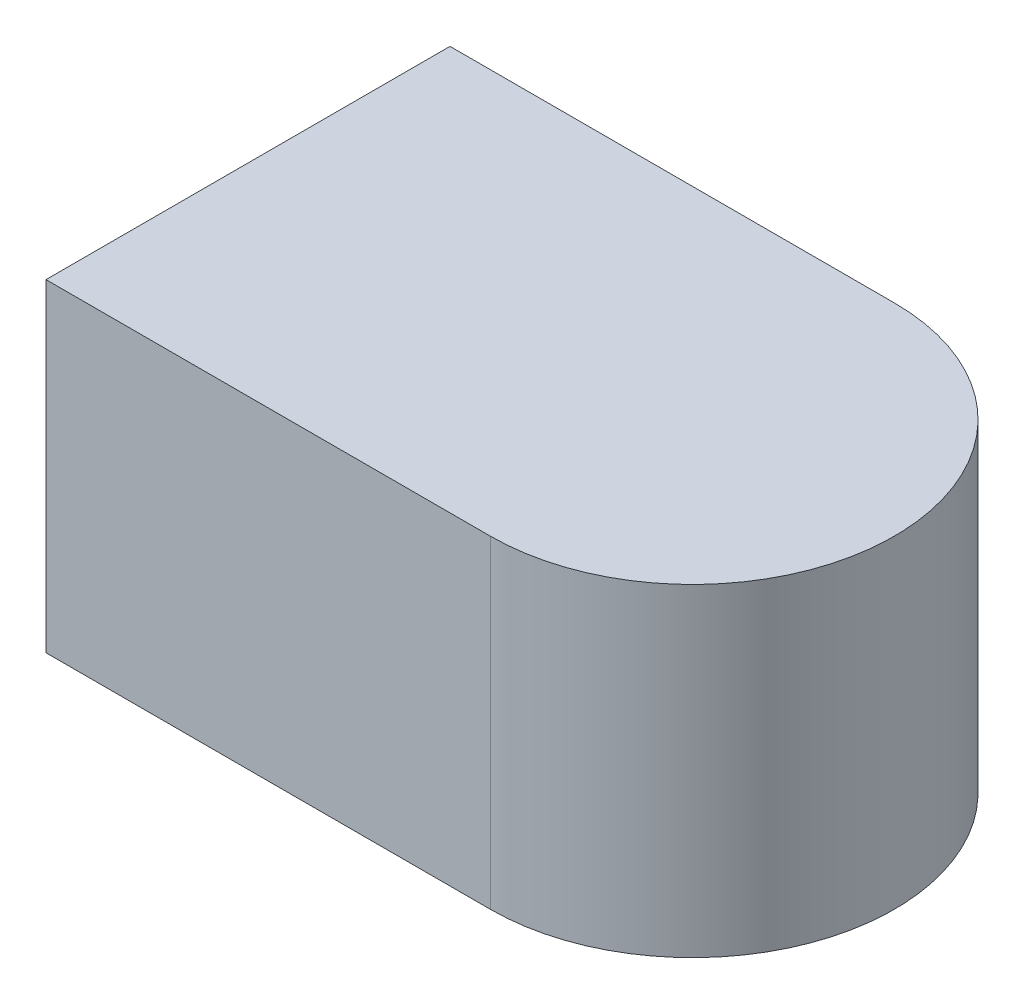
ISO-10303-21;
HEADER;
FILE_DESCRIPTION(('STEP AP214'),'2;1');
FILE_NAME('part.step','',(''),(''),'','','');
FILE_SCHEMA(('AUTOMOTIVE_DESIGN { 1 0 10303 214 1 1 1 1 }'));
ENDSEC;
DATA;
#1=APPLICATION_CONTEXT('core data for automotive mechanical design processes');
#2=APPLICATION_PROTOCOL_DEFINITION('international standard','automotive_design',2000,#1);
#3=PRODUCT_CONTEXT('',#1,'mechanical');
#4=PRODUCT('Part','Part','',(#3));
#5=PRODUCT_RELATED_PRODUCT_CATEGORY('part','',(#4));
#6=PRODUCT_DEFINITION_FORMATION('','',#4);
#7=PRODUCT_DEFINITION_CONTEXT('part definition',#1,'design');
#8=PRODUCT_DEFINITION('design','',#6,#7);
#9=PRODUCT_DEFINITION_SHAPE('','',#8);
#10=(LENGTH_UNIT() NAMED_UNIT(*) SI_UNIT(.MILLI.,.METRE.));
#11=(NAMED_UNIT(*) PLANE_ANGLE_UNIT() SI_UNIT($,.RADIAN.));
#12=(NAMED_UNIT(*) SI_UNIT($,.STERADIAN.) SOLID_ANGLE_UNIT());
#13=UNCERTAINTY_MEASURE_WITH_UNIT(LENGTH_MEASURE(1.E-05),#10,'distance_accuracy_value','');
#14=(GEOMETRIC_REPRESENTATION_CONTEXT(3) GLOBAL_UNCERTAINTY_ASSIGNED_CONTEXT((#13)) GLOBAL_UNIT_ASSIGNED_CONTEXT((#10,
#11,#12)) REPRESENTATION_CONTEXT('',''));
#15=CARTESIAN_POINT('',(0.,0.,0.));
#16=DIRECTION('',(0.,0.,1.));
#17=DIRECTION('',(1.,0.,0.));
#18=AXIS2_PLACEMENT_3D('',#15,#16,#17);
#19=CARTESIAN_POINT('',(0.,0.,0.));
#20=DIRECTION('',(0.,-1.,0.));
#21=DIRECTION('',(-1.,0.,0.));
#22=AXIS2_PLACEMENT_3D('',#19,#20,#21);
#23=PLANE('',#22);
#24=CARTESIAN_POINT('',(-1.225,0.,-0.25));
#25=DIRECTION('',(0.,-1.,0.));
#26=DIRECTION('',(0.,0.,-1.));
#27=AXIS2_PLACEMENT_3D('',#24,#25,#26);
#28=CIRCLE('',#27,0.125);
#29=CARTESIAN_POINT('',(-1.225,0.,-0.375));
#30=VERTEX_POINT('',#29);
#31=CARTESIAN_POINT('',(-1.225,0.,-0.125));
#32=VERTEX_POINT('',#31);
#33=EDGE_CURVE('E11',#30,#32,#28,.T.);
#34=ORIENTED_EDGE('',*,*,#33,.T.);
#35=DIRECTION('',(-1.,0.,0.));
#36=VECTOR('',#35,1.);
#37=CARTESIAN_POINT('',(-1.225,0.,-0.125));
#38=LINE('',#37,#36);
#39=CARTESIAN_POINT('',(-1.5,0.,-0.125));
#40=VERTEX_POINT('',#39);
#41=EDGE_CURVE('E24',#32,#40,#38,.T.);
#42=ORIENTED_EDGE('',*,*,#41,.T.);
#43=DIRECTION('',(0.,0.,-1.));
#44=VECTOR('',#43,1.);
#45=CARTESIAN_POINT('',(-1.5,0.,-0.125));
#46=LINE('',#45,#44);
#47=CARTESIAN_POINT('',(-1.5,0.,-0.375));
#48=VERTEX_POINT('',#47);
#49=EDGE_CURVE('E62',#40,#48,#46,.T.);
#50=ORIENTED_EDGE('',*,*,#49,.T.);
#51=DIRECTION('',(1.,0.,0.));
#52=VECTOR('',#51,1.);
#53=CARTESIAN_POINT('',(-1.5,0.,-0.375));
#54=LINE('',#53,#52);
#55=EDGE_CURVE('E36',#48,#30,#54,.T.);
#56=ORIENTED_EDGE('',*,*,#55,.T.);
#57=EDGE_LOOP('',(#34,#42,#50,#56));
#58=FACE_BOUND('',#57,.T.);
#59=ADVANCED_FACE('F17',(#58),#23,.T.);
#60=CARTESIAN_POINT('',(-1.5,0.,-0.375));
#61=DIRECTION('',(0.,0.,1.));
#62=DIRECTION('',(1.,0.,0.));
#63=AXIS2_PLACEMENT_3D('',#60,#61,#62);
#64=PLANE('',#63);
#65=DIRECTION('',(0.,1.,0.));
#66=VECTOR('',#65,1.);
#67=CARTESIAN_POINT('',(-1.5,0.,-0.375));
#68=LINE('',#67,#66);
#69=CARTESIAN_POINT('',(-1.5,0.2,-0.375));
#70=VERTEX_POINT('',#69);
#71=EDGE_CURVE('E84',#48,#70,#68,.T.);
#72=ORIENTED_EDGE('',*,*,#71,.T.);
#73=DIRECTION('',(1.,0.,0.));
#74=VECTOR('',#73,1.);
#75=CARTESIAN_POINT('',(-1.5,0.2,-0.375));
#76=LINE('',#75,#74);
#77=CARTESIAN_POINT('',(-1.225,0.2,-0.375));
#78=VERTEX_POINT('',#77);
#79=EDGE_CURVE('E74',#70,#78,#76,.T.);
#80=ORIENTED_EDGE('',*,*,#79,.T.);
#81=DIRECTION('',(0.,1.,0.));
#82=VECTOR('',#81,1.);
#83=CARTESIAN_POINT('',(-1.225,0.,-0.375));
#84=LINE('',#83,#82);
#85=EDGE_CURVE('E81',#30,#78,#84,.T.);
#86=ORIENTED_EDGE('',*,*,#85,.F.);
#87=ORIENTED_EDGE('',*,*,#55,.F.);
#88=EDGE_LOOP('',(#72,#80,#86,#87));
#89=FACE_BOUND('',#88,.T.);
#90=ADVANCED_FACE('F91',(#89),#64,.F.);
#91=CARTESIAN_POINT('',(-1.225,0.,-0.25));
#92=DIRECTION('',(0.,-1.,0.));
#93=DIRECTION('',(-1.,0.,0.));
#94=AXIS2_PLACEMENT_3D('',#91,#92,#93);
#95=CYLINDRICAL_SURFACE('',#94,0.125);
#96=ORIENTED_EDGE('',*,*,#85,.T.);
#97=CARTESIAN_POINT('',(-1.225,0.2,-0.25));
#98=DIRECTION('',(0.,-1.,0.));
#99=DIRECTION('',(0.,0.,-1.));
#100=AXIS2_PLACEMENT_3D('',#97,#98,#99);
#101=CIRCLE('',#100,0.125);
#102=CARTESIAN_POINT('',(-1.225,0.2,-0.125));
#103=VERTEX_POINT('',#102);
#104=EDGE_CURVE('E79',#78,#103,#101,.T.);
#105=ORIENTED_EDGE('',*,*,#104,.T.);
#106=DIRECTION('',(0.,1.,0.));
#107=VECTOR('',#106,1.);
#108=CARTESIAN_POINT('',(-1.225,0.,-0.125));
#109=LINE('',#108,#107);
#110=EDGE_CURVE('E68',#32,#103,#109,.T.);
#111=ORIENTED_EDGE('',*,*,#110,.F.);
#112=ORIENTED_EDGE('',*,*,#33,.F.);
#113=EDGE_LOOP('',(#96,#105,#111,#112));
#114=FACE_BOUND('',#113,.T.);
#115=ADVANCED_FACE('F89',(#114),#95,.T.);
#116=CARTESIAN_POINT('',(-1.225,0.,-0.125));
#117=DIRECTION('',(0.,0.,-1.));
#118=DIRECTION('',(-1.,0.,0.));
#119=AXIS2_PLACEMENT_3D('',#116,#117,#118);
#120=PLANE('',#119);
#121=ORIENTED_EDGE('',*,*,#110,.T.);
#122=DIRECTION('',(-1.,0.,0.));
#123=VECTOR('',#122,1.);
#124=CARTESIAN_POINT('',(-1.225,0.2,-0.125));
#125=LINE('',#124,#123);
#126=CARTESIAN_POINT('',(-1.5,0.2,-0.125));
#127=VERTEX_POINT('',#126);
#128=EDGE_CURVE('E63',#103,#127,#125,.T.);
#129=ORIENTED_EDGE('',*,*,#128,.T.);
#130=DIRECTION('',(0.,1.,0.));
#131=VECTOR('',#130,1.);
#132=CARTESIAN_POINT('',(-1.5,0.,-0.125));
#133=LINE('',#132,#131);
#134=EDGE_CURVE('E56',#40,#127,#133,.T.);
#135=ORIENTED_EDGE('',*,*,#134,.F.);
#136=ORIENTED_EDGE('',*,*,#41,.F.);
#137=EDGE_LOOP('',(#121,#129,#135,#136));
#138=FACE_BOUND('',#137,.T.);
#139=ADVANCED_FACE('F66',(#138),#120,.F.);
#140=CARTESIAN_POINT('',(-1.5,0.,-0.125));
#141=DIRECTION('',(1.,0.,0.));
#142=DIRECTION('',(0.,0.,-1.));
#143=AXIS2_PLACEMENT_3D('',#140,#141,#142);
#144=PLANE('',#143);
#145=ORIENTED_EDGE('',*,*,#134,.T.);
#146=DIRECTION('',(0.,0.,-1.));
#147=VECTOR('',#146,1.);
#148=CARTESIAN_POINT('',(-1.5,0.2,-0.125));
#149=LINE('',#148,#147);
#150=EDGE_CURVE('E61',#127,#70,#149,.T.);
#151=ORIENTED_EDGE('',*,*,#150,.T.);
#152=ORIENTED_EDGE('',*,*,#71,.F.);
#153=ORIENTED_EDGE('',*,*,#49,.F.);
#154=EDGE_LOOP('',(#145,#151,#152,#153));
#155=FACE_BOUND('',#154,.T.);
#156=ADVANCED_FACE('F58',(#155),#144,.F.);
#157=CARTESIAN_POINT('',(0.,0.2,0.));
#158=DIRECTION('',(0.,-1.,0.));
#159=DIRECTION('',(-1.,0.,0.));
#160=AXIS2_PLACEMENT_3D('',#157,#158,#159);
#161=PLANE('',#160);
#162=ORIENTED_EDGE('',*,*,#150,.F.);
#163=ORIENTED_EDGE('',*,*,#128,.F.);
#164=ORIENTED_EDGE('',*,*,#104,.F.);
#165=ORIENTED_EDGE('',*,*,#79,.F.);
#166=EDGE_LOOP('',(#162,#163,#164,#165));
#167=FACE_BOUND('',#166,.T.);
#168=ADVANCED_FACE('F72',(#167),#161,.F.);
#169=CLOSED_SHELL('',(#59,#90,#115,#139,#156,#168));
#170=MANIFOLD_SOLID_BREP('B1',#169);
#171=ADVANCED_BREP_SHAPE_REPRESENTATION('',(#18,#170),#14);
#172=SHAPE_DEFINITION_REPRESENTATION(#9,#171);
ENDSEC;
END-ISO-10303-21;
